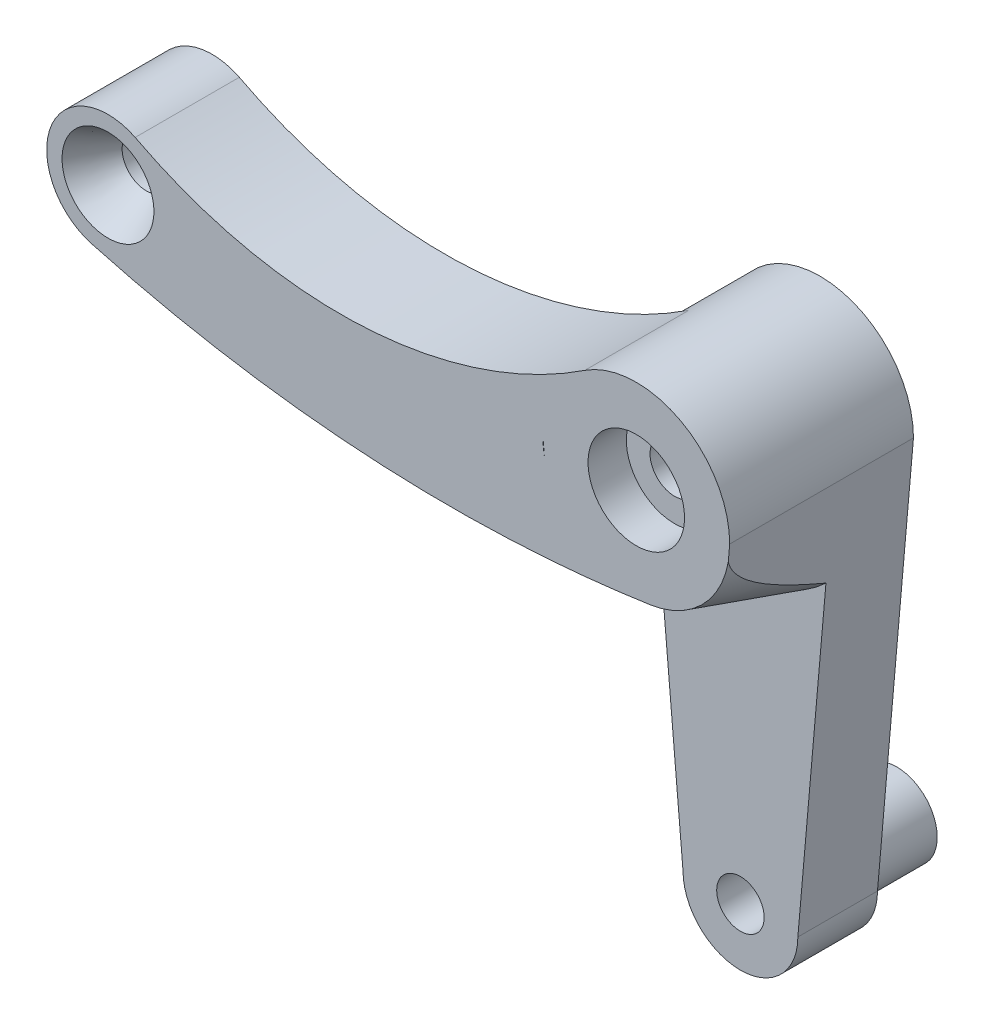
ISO-10303-21;
HEADER;
FILE_DESCRIPTION(('STEP AP214'),'2;1');
FILE_NAME('part.step','',(''),(''),'','','');
FILE_SCHEMA(('AUTOMOTIVE_DESIGN { 1 0 10303 214 1 1 1 1 }'));
ENDSEC;
DATA;
#1=APPLICATION_CONTEXT('core data for automotive mechanical design processes');
#2=APPLICATION_PROTOCOL_DEFINITION('international standard','automotive_design',2000,#1);
#3=PRODUCT_CONTEXT('',#1,'mechanical');
#4=PRODUCT('Part','Part','',(#3));
#5=PRODUCT_RELATED_PRODUCT_CATEGORY('part','',(#4));
#6=PRODUCT_DEFINITION_FORMATION('','',#4);
#7=PRODUCT_DEFINITION_CONTEXT('part definition',#1,'design');
#8=PRODUCT_DEFINITION('design','',#6,#7);
#9=PRODUCT_DEFINITION_SHAPE('','',#8);
#10=(LENGTH_UNIT() NAMED_UNIT(*) SI_UNIT(.MILLI.,.METRE.));
#11=(NAMED_UNIT(*) PLANE_ANGLE_UNIT() SI_UNIT($,.RADIAN.));
#12=(NAMED_UNIT(*) SI_UNIT($,.STERADIAN.) SOLID_ANGLE_UNIT());
#13=UNCERTAINTY_MEASURE_WITH_UNIT(LENGTH_MEASURE(1.E-05),#10,'distance_accuracy_value','');
#14=(GEOMETRIC_REPRESENTATION_CONTEXT(3) GLOBAL_UNCERTAINTY_ASSIGNED_CONTEXT((#13)) GLOBAL_UNIT_ASSIGNED_CONTEXT((#10,
#11,#12)) REPRESENTATION_CONTEXT('',''));
#15=CARTESIAN_POINT('',(0.,0.,0.));
#16=DIRECTION('',(0.,0.,1.));
#17=DIRECTION('',(1.,0.,0.));
#18=AXIS2_PLACEMENT_3D('',#15,#16,#17);
#19=CARTESIAN_POINT('',(-34.5,0.,12.));
#20=DIRECTION('',(0.,0.,-1.));
#21=DIRECTION('',(-1.,0.,0.));
#22=AXIS2_PLACEMENT_3D('',#19,#20,#21);
#23=CYLINDRICAL_SURFACE('',#22,1.575);
#24=CARTESIAN_POINT('',(-34.5,0.,5.2));
#25=DIRECTION('',(0.,0.,1.));
#26=DIRECTION('',(1.,0.,0.));
#27=AXIS2_PLACEMENT_3D('',#24,#25,#26);
#28=CIRCLE('',#27,1.575);
#29=CARTESIAN_POINT('',(-32.925,0.,5.2));
#30=VERTEX_POINT('',#29);
#31=EDGE_CURVE('E334',#30,#30,#28,.T.);
#32=ORIENTED_EDGE('',*,*,#31,.F.);
#33=EDGE_LOOP('',(#32));
#34=FACE_BOUND('',#33,.T.);
#35=CARTESIAN_POINT('',(-34.5,0.,9.5));
#36=DIRECTION('',(0.,0.,-1.));
#37=DIRECTION('',(-1.,0.,0.));
#38=AXIS2_PLACEMENT_3D('',#35,#36,#37);
#39=CIRCLE('',#38,1.575);
#40=CARTESIAN_POINT('',(-36.075,0.,9.5));
#41=VERTEX_POINT('',#40);
#42=EDGE_CURVE('E367',#41,#41,#39,.T.);
#43=ORIENTED_EDGE('',*,*,#42,.F.);
#44=EDGE_LOOP('',(#43));
#45=FACE_BOUND('',#44,.T.);
#46=ADVANCED_FACE('F35',(#34,#45),#23,.F.);
#47=CARTESIAN_POINT('',(0.,0.,12.));
#48=DIRECTION('',(0.,0.,-1.));
#49=DIRECTION('',(-1.,0.,0.));
#50=AXIS2_PLACEMENT_3D('',#47,#48,#49);
#51=CYLINDRICAL_SURFACE('',#50,1.6);
#52=CARTESIAN_POINT('',(0.,0.,2.5));
#53=DIRECTION('',(0.,0.,-1.));
#54=DIRECTION('',(-1.,0.,0.));
#55=AXIS2_PLACEMENT_3D('',#52,#53,#54);
#56=CIRCLE('',#55,1.6);
#57=CARTESIAN_POINT('',(-1.6,0.,2.5));
#58=VERTEX_POINT('',#57);
#59=EDGE_CURVE('E40',#58,#58,#56,.T.);
#60=ORIENTED_EDGE('',*,*,#59,.T.);
#61=EDGE_LOOP('',(#60));
#62=FACE_BOUND('',#61,.T.);
#63=CARTESIAN_POINT('',(0.,0.,9.5));
#64=DIRECTION('',(0.,0.,1.));
#65=DIRECTION('',(1.,0.,0.));
#66=AXIS2_PLACEMENT_3D('',#63,#64,#65);
#67=CIRCLE('',#66,1.6);
#68=CARTESIAN_POINT('',(1.6,0.,9.5));
#69=VERTEX_POINT('',#68);
#70=EDGE_CURVE('E362',#69,#69,#67,.T.);
#71=ORIENTED_EDGE('',*,*,#70,.T.);
#72=EDGE_LOOP('',(#71));
#73=FACE_BOUND('',#72,.T.);
#74=ADVANCED_FACE('F255',(#62,#73),#51,.F.);
#75=CARTESIAN_POINT('',(0.,0.,12.));
#76=DIRECTION('',(0.,0.,-1.));
#77=DIRECTION('',(-1.,0.,0.));
#78=AXIS2_PLACEMENT_3D('',#75,#76,#77);
#79=CYLINDRICAL_SURFACE('',#78,6.1);
#80=CARTESIAN_POINT('',(0.,0.,5.2));
#81=DIRECTION('',(0.,0.,-1.));
#82=DIRECTION('',(1.,0.,0.));
#83=AXIS2_PLACEMENT_3D('',#80,#81,#82);
#84=CIRCLE('',#83,6.1);
#85=CARTESIAN_POINT('',(-6.1,0.,5.2));
#86=VERTEX_POINT('',#85);
#87=CARTESIAN_POINT('',(-3.36501602680877,5.08789417532638,5.2));
#88=VERTEX_POINT('',#87);
#89=EDGE_CURVE('E346',#86,#88,#84,.T.);
#90=ORIENTED_EDGE('',*,*,#89,.T.);
#91=DIRECTION('',(0.,0.,-1.));
#92=VECTOR('',#91,1.);
#93=CARTESIAN_POINT('',(-3.36501602680877,5.08789417532638,12.));
#94=LINE('',#93,#92);
#95=CARTESIAN_POINT('',(-3.36501602680877,5.08789417532638,12.));
#96=VERTEX_POINT('',#95);
#97=EDGE_CURVE('E155',#96,#88,#94,.T.);
#98=ORIENTED_EDGE('',*,*,#97,.F.);
#99=CARTESIAN_POINT('',(0.,0.,12.));
#100=DIRECTION('',(0.,0.,1.));
#101=DIRECTION('',(1.,0.,0.));
#102=AXIS2_PLACEMENT_3D('',#99,#100,#101);
#103=CIRCLE('',#102,6.1);
#104=CARTESIAN_POINT('',(6.1,0.,12.));
#105=VERTEX_POINT('',#104);
#106=EDGE_CURVE('E142',#105,#96,#103,.T.);
#107=ORIENTED_EDGE('',*,*,#106,.F.);
#108=DIRECTION('',(0.,0.,-1.));
#109=VECTOR('',#108,1.);
#110=CARTESIAN_POINT('',(6.1,0.,12.));
#111=LINE('',#110,#109);
#112=CARTESIAN_POINT('',(6.1,0.,0.));
#113=VERTEX_POINT('',#112);
#114=EDGE_CURVE('E200',#105,#113,#111,.T.);
#115=ORIENTED_EDGE('',*,*,#114,.T.);
#116=CARTESIAN_POINT('',(0.,0.,0.));
#117=DIRECTION('',(0.,0.,1.));
#118=DIRECTION('',(1.,0.,0.));
#119=AXIS2_PLACEMENT_3D('',#116,#117,#118);
#120=CIRCLE('',#119,6.1);
#121=CARTESIAN_POINT('',(-6.1,0.,0.));
#122=VERTEX_POINT('',#121);
#123=EDGE_CURVE('E190',#113,#122,#120,.T.);
#124=ORIENTED_EDGE('',*,*,#123,.T.);
#125=DIRECTION('',(0.,0.,-1.));
#126=VECTOR('',#125,1.);
#127=CARTESIAN_POINT('',(-6.1,0.,12.));
#128=LINE('',#127,#126);
#129=EDGE_CURVE('E196',#86,#122,#128,.T.);
#130=ORIENTED_EDGE('',*,*,#129,.F.);
#131=EDGE_LOOP('',(#90,#98,#107,#115,#124,#130));
#132=FACE_BOUND('',#131,.T.);
#133=ADVANCED_FACE('F252',(#132),#79,.T.);
#134=CARTESIAN_POINT('',(0.,0.,5.2));
#135=DIRECTION('',(0.,0.,1.));
#136=DIRECTION('',(1.,0.,0.));
#137=AXIS2_PLACEMENT_3D('',#134,#135,#136);
#138=PLANE('',#137);
#139=CARTESIAN_POINT('',(0.,-26.8,5.2));
#140=DIRECTION('',(0.,0.,1.));
#141=DIRECTION('',(1.,0.,0.));
#142=AXIS2_PLACEMENT_3D('',#139,#140,#141);
#143=CIRCLE('',#142,1.55);
#144=CARTESIAN_POINT('',(1.55,-26.8,5.2));
#145=VERTEX_POINT('',#144);
#146=EDGE_CURVE('E176',#145,#145,#143,.T.);
#147=ORIENTED_EDGE('',*,*,#146,.F.);
#148=EDGE_LOOP('',(#147));
#149=FACE_BOUND('',#148,.T.);
#150=CARTESIAN_POINT('',(0.,0.,5.2));
#151=DIRECTION('',(0.,0.,1.));
#152=DIRECTION('',(1.,0.,0.));
#153=AXIS2_PLACEMENT_3D('',#150,#151,#152);
#154=CIRCLE('',#153,8.1);
#155=CARTESIAN_POINT('',(5.58562427825305,-5.86607206077372,5.2));
#156=VERTEX_POINT('',#155);
#157=CARTESIAN_POINT('',(1.19677567262764,-8.01110029829902,5.2));
#158=VERTEX_POINT('',#157);
#159=EDGE_CURVE('E213',#156,#158,#154,.F.);
#160=ORIENTED_EDGE('',*,*,#159,.T.);
#161=CARTESIAN_POINT('',(-12.1716520767408,81.4758586867667,5.2));
#162=DIRECTION('',(0.,0.,1.));
#163=DIRECTION('',(1.,0.,0.));
#164=AXIS2_PLACEMENT_3D('',#161,#162,#163);
#165=CIRCLE('',#164,90.4800015964021);
#166=CARTESIAN_POINT('',(-5.33315072148599,-8.74534496347895,5.2));
#167=VERTEX_POINT('',#166);
#168=EDGE_CURVE('E215',#158,#167,#165,.F.);
#169=ORIENTED_EDGE('',*,*,#168,.T.);
#170=DIRECTION('',(0.0873513906763995,-0.996177561756386,0.));
#171=VECTOR('',#170,1.);
#172=CARTESIAN_POINT('',(-6.00691076147216,-1.06161344363656,5.2));
#173=LINE('',#172,#171);
#174=CARTESIAN_POINT('',(-3.75,-26.8,5.2));
#175=VERTEX_POINT('',#174);
#176=EDGE_CURVE('E166',#167,#175,#173,.T.);
#177=ORIENTED_EDGE('',*,*,#176,.T.);
#178=CARTESIAN_POINT('',(0.,-26.8,5.2));
#179=DIRECTION('',(0.,0.,1.));
#180=DIRECTION('',(1.,0.,0.));
#181=AXIS2_PLACEMENT_3D('',#178,#179,#180);
#182=CIRCLE('',#181,3.75);
#183=CARTESIAN_POINT('',(3.75,-26.8,5.2));
#184=VERTEX_POINT('',#183);
#185=EDGE_CURVE('E165',#175,#184,#182,.T.);
#186=ORIENTED_EDGE('',*,*,#185,.T.);
#187=DIRECTION('',(0.0873513906763995,0.996177561756386,0.));
#188=VECTOR('',#187,1.);
#189=CARTESIAN_POINT('',(3.75,-26.8,5.2));
#190=LINE('',#189,#188);
#191=EDGE_CURVE('E168',#184,#156,#190,.T.);
#192=ORIENTED_EDGE('',*,*,#191,.T.);
#193=EDGE_LOOP('',(#160,#169,#177,#186,#192));
#194=FACE_BOUND('',#193,.T.);
#195=ADVANCED_FACE('F254',(#149,#194),#138,.T.);
#196=CARTESIAN_POINT('',(0.,-26.8,0.));
#197=DIRECTION('',(0.,0.,1.));
#198=DIRECTION('',(1.,0.,0.));
#199=AXIS2_PLACEMENT_3D('',#196,#197,#198);
#200=PLANE('',#199);
#201=CARTESIAN_POINT('',(0.,0.,0.));
#202=DIRECTION('',(0.,0.,-1.));
#203=DIRECTION('',(-1.,0.,0.));
#204=AXIS2_PLACEMENT_3D('',#201,#202,#203);
#205=CIRCLE('',#204,3.15);
#206=CARTESIAN_POINT('',(-3.15,0.,0.));
#207=VERTEX_POINT('',#206);
#208=EDGE_CURVE('E310',#207,#207,#205,.T.);
#209=ORIENTED_EDGE('',*,*,#208,.F.);
#210=EDGE_LOOP('',(#209));
#211=FACE_BOUND('',#210,.T.);
#212=CARTESIAN_POINT('',(0.,-26.8,0.));
#213=DIRECTION('',(0.,0.,1.));
#214=DIRECTION('',(1.,0.,0.));
#215=AXIS2_PLACEMENT_3D('',#212,#213,#214);
#216=CIRCLE('',#215,3.15);
#217=CARTESIAN_POINT('',(3.15,-26.8,0.));
#218=VERTEX_POINT('',#217);
#219=EDGE_CURVE('E210',#218,#218,#216,.T.);
#220=ORIENTED_EDGE('',*,*,#219,.T.);
#221=EDGE_LOOP('',(#220));
#222=FACE_BOUND('',#221,.T.);
#223=CARTESIAN_POINT('',(0.,-26.8,0.));
#224=DIRECTION('',(0.,0.,1.));
#225=DIRECTION('',(1.,0.,0.));
#226=AXIS2_PLACEMENT_3D('',#223,#224,#225);
#227=CIRCLE('',#226,3.75);
#228=CARTESIAN_POINT('',(-3.75,-26.8,0.));
#229=VERTEX_POINT('',#228);
#230=CARTESIAN_POINT('',(3.75,-26.8,0.));
#231=VERTEX_POINT('',#230);
#232=EDGE_CURVE('E185',#229,#231,#227,.T.);
#233=ORIENTED_EDGE('',*,*,#232,.F.);
#234=DIRECTION('',(0.0873513906763996,-0.996177561756386,0.));
#235=VECTOR('',#234,1.);
#236=CARTESIAN_POINT('',(-3.75,-26.8,0.));
#237=LINE('',#236,#235);
#238=EDGE_CURVE('E179',#122,#229,#237,.T.);
#239=ORIENTED_EDGE('',*,*,#238,.F.);
#240=ORIENTED_EDGE('',*,*,#123,.F.);
#241=DIRECTION('',(0.0873513906763996,0.996177561756386,0.));
#242=VECTOR('',#241,1.);
#243=CARTESIAN_POINT('',(6.1,0.,0.));
#244=LINE('',#243,#242);
#245=EDGE_CURVE('E188',#231,#113,#244,.T.);
#246=ORIENTED_EDGE('',*,*,#245,.F.);
#247=EDGE_LOOP('',(#233,#239,#240,#246));
#248=FACE_BOUND('',#247,.T.);
#249=ADVANCED_FACE('F246',(#211,#222,#248),#200,.F.);
#250=CARTESIAN_POINT('',(0.,-26.8,12.));
#251=DIRECTION('',(0.,0.,-1.));
#252=DIRECTION('',(-1.,0.,0.));
#253=AXIS2_PLACEMENT_3D('',#250,#251,#252);
#254=CYLINDRICAL_SURFACE('',#253,3.75);
#255=ORIENTED_EDGE('',*,*,#185,.F.);
#256=DIRECTION('',(0.,0.,-1.));
#257=VECTOR('',#256,1.);
#258=CARTESIAN_POINT('',(-3.75,-26.8,12.));
#259=LINE('',#258,#257);
#260=EDGE_CURVE('E184',#175,#229,#259,.T.);
#261=ORIENTED_EDGE('',*,*,#260,.T.);
#262=ORIENTED_EDGE('',*,*,#232,.T.);
#263=DIRECTION('',(0.,0.,-1.));
#264=VECTOR('',#263,1.);
#265=CARTESIAN_POINT('',(3.75,-26.8,12.));
#266=LINE('',#265,#264);
#267=EDGE_CURVE('E203',#184,#231,#266,.T.);
#268=ORIENTED_EDGE('',*,*,#267,.F.);
#269=EDGE_LOOP('',(#255,#261,#262,#268));
#270=FACE_BOUND('',#269,.T.);
#271=ADVANCED_FACE('F243',(#270),#254,.T.);
#272=CARTESIAN_POINT('',(0.,-26.8,12.));
#273=DIRECTION('',(0.,0.,-1.));
#274=DIRECTION('',(-1.,0.,0.));
#275=AXIS2_PLACEMENT_3D('',#272,#273,#274);
#276=CYLINDRICAL_SURFACE('',#275,1.55);
#277=ORIENTED_EDGE('',*,*,#146,.T.);
#278=EDGE_LOOP('',(#277));
#279=FACE_BOUND('',#278,.T.);
#280=CARTESIAN_POINT('',(0.,-26.8,-5.));
#281=DIRECTION('',(0.,0.,-1.));
#282=DIRECTION('',(-1.,0.,0.));
#283=AXIS2_PLACEMENT_3D('',#280,#281,#282);
#284=CIRCLE('',#283,1.55);
#285=CARTESIAN_POINT('',(-1.55,-26.8,-5.));
#286=VERTEX_POINT('',#285);
#287=EDGE_CURVE('E150',#286,#286,#284,.T.);
#288=ORIENTED_EDGE('',*,*,#287,.T.);
#289=EDGE_LOOP('',(#288));
#290=FACE_BOUND('',#289,.T.);
#291=ADVANCED_FACE('F245',(#279,#290),#276,.F.);
#292=CARTESIAN_POINT('',(0.,-26.8,12.));
#293=DIRECTION('',(0.,0.,1.));
#294=DIRECTION('',(1.,0.,0.));
#295=AXIS2_PLACEMENT_3D('',#292,#293,#294);
#296=PLANE('',#295);
#297=CARTESIAN_POINT('',(-34.5,0.,12.));
#298=DIRECTION('',(0.,0.,-1.));
#299=DIRECTION('',(-1.,0.,0.));
#300=AXIS2_PLACEMENT_3D('',#297,#298,#299);
#301=CIRCLE('',#300,3.);
#302=CARTESIAN_POINT('',(-37.5,0.,12.));
#303=VERTEX_POINT('',#302);
#304=EDGE_CURVE('E370',#303,#303,#301,.T.);
#305=ORIENTED_EDGE('',*,*,#304,.T.);
#306=EDGE_LOOP('',(#305));
#307=FACE_BOUND('',#306,.T.);
#308=CARTESIAN_POINT('',(0.,0.,12.));
#309=DIRECTION('',(0.,0.,1.));
#310=DIRECTION('',(1.,0.,0.));
#311=AXIS2_PLACEMENT_3D('',#308,#309,#310);
#312=CIRCLE('',#311,3.15);
#313=CARTESIAN_POINT('',(3.15,0.,12.));
#314=VERTEX_POINT('',#313);
#315=EDGE_CURVE('E359',#314,#314,#312,.T.);
#316=ORIENTED_EDGE('',*,*,#315,.F.);
#317=EDGE_LOOP('',(#316));
#318=FACE_BOUND('',#317,.T.);
#319=ORIENTED_EDGE('',*,*,#106,.T.);
#320=CARTESIAN_POINT('',(-19.3185063382412,29.2095238451383,12.));
#321=DIRECTION('',(0.,0.,-1.));
#322=DIRECTION('',(1.,0.,0.));
#323=AXIS2_PLACEMENT_3D('',#320,#321,#322);
#324=CIRCLE('',#323,28.9200081439221);
#325=CARTESIAN_POINT('',(-32.7223042418856,3.58326635788941,12.));
#326=VERTEX_POINT('',#325);
#327=EDGE_CURVE('E136',#96,#326,#324,.T.);
#328=ORIENTED_EDGE('',*,*,#327,.T.);
#329=CARTESIAN_POINT('',(-34.5,0.,12.));
#330=DIRECTION('',(0.,0.,1.));
#331=DIRECTION('',(1.,0.,0.));
#332=AXIS2_PLACEMENT_3D('',#329,#330,#331);
#333=CIRCLE('',#332,4.);
#334=CARTESIAN_POINT('',(-35.5572134233582,-3.85775838764835,12.));
#335=VERTEX_POINT('',#334);
#336=EDGE_CURVE('E124',#326,#335,#333,.T.);
#337=ORIENTED_EDGE('',*,*,#336,.T.);
#338=CARTESIAN_POINT('',(-12.1716520767408,81.4758586867667,12.));
#339=DIRECTION('',(0.,0.,1.));
#340=DIRECTION('',(1.,0.,0.));
#341=AXIS2_PLACEMENT_3D('',#338,#339,#340);
#342=CIRCLE('',#341,88.480001596402);
#343=CARTESIAN_POINT('',(-5.50786596339798,-6.7528477365677,12.));
#344=VERTEX_POINT('',#343);
#345=EDGE_CURVE('E335',#335,#344,#342,.T.);
#346=ORIENTED_EDGE('',*,*,#345,.T.);
#347=CARTESIAN_POINT('',(0.901275506546741,-6.03305084192889,12.));
#348=VERTEX_POINT('',#347);
#349=EDGE_CURVE('E135',#344,#348,#342,.T.);
#350=ORIENTED_EDGE('',*,*,#349,.T.);
#351=CARTESIAN_POINT('',(0.,0.,12.));
#352=DIRECTION('',(0.,0.,-1.));
#353=DIRECTION('',(1.,0.,0.));
#354=AXIS2_PLACEMENT_3D('',#351,#352,#353);
#355=CIRCLE('',#354,6.1);
#356=CARTESIAN_POINT('',(6.00691076147217,-1.06161344363654,12.));
#357=VERTEX_POINT('',#356);
#358=EDGE_CURVE('E161',#357,#348,#355,.T.);
#359=ORIENTED_EDGE('',*,*,#358,.F.);
#360=DIRECTION('',(0.0873513906763996,0.996177561756386,0.));
#361=VECTOR('',#360,1.);
#362=CARTESIAN_POINT('',(6.1,0.,12.));
#363=LINE('',#362,#361);
#364=EDGE_CURVE('E177',#357,#105,#363,.T.);
#365=ORIENTED_EDGE('',*,*,#364,.T.);
#366=EDGE_LOOP('',(#319,#328,#337,#346,#350,#359,#365));
#367=FACE_BOUND('',#366,.T.);
#368=CARTESIAN_POINT('',(0.,0.,12.));
#369=DIRECTION('',(0.,0.,-1.));
#370=DIRECTION('',(1.,0.,0.));
#371=AXIS2_PLACEMENT_3D('',#368,#369,#370);
#372=CIRCLE('',#371,6.1);
#373=CARTESIAN_POINT('',(-6.00691076147217,-1.06161344363656,12.));
#374=VERTEX_POINT('',#373);
#375=CARTESIAN_POINT('',(-6.1,0.,12.));
#376=VERTEX_POINT('',#375);
#377=EDGE_CURVE('E337',#374,#376,#372,.T.);
#378=ORIENTED_EDGE('',*,*,#377,.T.);
#379=DIRECTION('',(0.0873513906763996,-0.996177561756386,0.));
#380=VECTOR('',#379,1.);
#381=CARTESIAN_POINT('',(-3.75,-26.8,12.));
#382=LINE('',#381,#380);
#383=EDGE_CURVE('E181',#376,#374,#382,.T.);
#384=ORIENTED_EDGE('',*,*,#383,.T.);
#385=EDGE_LOOP('',(#378,#384));
#386=FACE_BOUND('',#385,.T.);
#387=ADVANCED_FACE('F139',(#307,#318,#367,#386),#296,.T.);
#388=CARTESIAN_POINT('',(6.1,0.,12.));
#389=DIRECTION('',(-0.996177561756386,0.0873513906763996,0.));
#390=DIRECTION('',(-0.0873513906763996,-0.996177561756386,0.));
#391=AXIS2_PLACEMENT_3D('',#388,#389,#390);
#392=PLANE('',#391);
#393=ORIENTED_EDGE('',*,*,#364,.F.);
#394=CARTESIAN_POINT('',(6.00691076147217,-1.06161344363654,12.));
#395=CARTESIAN_POINT('',(5.99959290657591,-1.14506812926192,11.9751362120786));
#396=CARTESIAN_POINT('',(5.99243235980993,-1.22672883280593,11.9449550579356));
#397=CARTESIAN_POINT('',(5.97847258999629,-1.38592961195723,11.875879947173));
#398=CARTESIAN_POINT('',(5.9716719683851,-1.4634856371401,11.8370233346674));
#399=CARTESIAN_POINT('',(5.9520605990004,-1.68713870076144,11.7116434654856));
#400=CARTESIAN_POINT('',(5.93974067235911,-1.8276382896918,11.6151440803785));
#401=CARTESIAN_POINT('',(5.91544789226449,-2.10467935630285,11.3977095441893));
#402=CARTESIAN_POINT('',(5.90356521581586,-2.2401924323979,11.2755087663684));
#403=CARTESIAN_POINT('',(5.88086373731854,-2.49908588930343,11.018665461085));
#404=CARTESIAN_POINT('',(5.87004637830578,-2.62244981336389,10.8840065241382));
#405=CARTESIAN_POINT('',(5.84895494164729,-2.86298194206493,10.6024445651833));
#406=CARTESIAN_POINT('',(5.83870594811579,-2.97986408106249,10.455298842726));
#407=CARTESIAN_POINT('',(5.81891825837843,-3.2055279470034,10.1550985524621));
#408=CARTESIAN_POINT('',(5.80937907159271,-3.31431526864485,10.0020481788367));
#409=CARTESIAN_POINT('',(5.7887895818787,-3.54912306623438,9.65686973716212));
#410=CARTESIAN_POINT('',(5.77787859154305,-3.67355478580691,9.46365880553215));
#411=CARTESIAN_POINT('',(5.75670729540617,-3.91499765238915,9.07259651436457));
#412=CARTESIAN_POINT('',(5.74644714893255,-4.03200698238626,8.87474403468251));
#413=CARTESIAN_POINT('',(5.72643438988905,-4.2602375961589,8.47533693525285));
#414=CARTESIAN_POINT('',(5.71668253596197,-4.3714502281784,8.27377735671169));
#415=CARTESIAN_POINT('',(5.69760506355262,-4.58901459437862,7.86802950031076));
#416=CARTESIAN_POINT('',(5.68827946630312,-4.69536608641545,7.66384109215122));
#417=CARTESIAN_POINT('',(5.6708452773313,-4.89419002873236,7.27275622565571));
#418=CARTESIAN_POINT('',(5.66270485526182,-4.98702548041842,7.08604509495851));
#419=CARTESIAN_POINT('',(5.64667240975651,-5.16986358235133,6.71122496150828));
#420=CARTESIAN_POINT('',(5.63878039452783,-5.25986613900172,6.52311591282251));
#421=CARTESIAN_POINT('',(5.62323767587374,-5.43711927088676,6.14638500444437));
#422=CARTESIAN_POINT('',(5.61558623934931,-5.52437820656962,5.95776709992487));
#423=CARTESIAN_POINT('',(5.60047114905192,-5.69675455549298,5.57956788235996));
#424=CARTESIAN_POINT('',(5.59300747820271,-5.78187216347542,5.38998665882175));
#425=CARTESIAN_POINT('',(5.58562427825302,-5.86607206077408,5.20000000000024));
#426=B_SPLINE_CURVE_WITH_KNOTS('',3,(#394,#395,#396,#397,#398,#399,#400,#401,#402,#403,#404,
#405,#406,#407,#408,#409,#410,#411,#412,#413,#414,#415,#416,#417,#418,#419,#420,#421,#422,#423,
#424,#425),.UNSPECIFIED.,.F.,.F.,(4,2,2,2,2,2,2,2,2,2,2,2,2,2,2,4),(0.,0.261662991599172,
0.522220638804977,1.03265787208609,1.58016338965039,2.12840061963555,2.69264497011371,
3.25649565177873,3.9464781448824,4.63662890007616,5.32778184670861,6.01896918372801,
6.64497054759166,7.27099257234823,7.894873198066,8.51869687865698),.UNSPECIFIED.);
#427=EDGE_CURVE('E11',#357,#156,#426,.T.);
#428=ORIENTED_EDGE('',*,*,#427,.T.);
#429=ORIENTED_EDGE('',*,*,#191,.F.);
#430=ORIENTED_EDGE('',*,*,#267,.T.);
#431=ORIENTED_EDGE('',*,*,#245,.T.);
#432=ORIENTED_EDGE('',*,*,#114,.F.);
#433=EDGE_LOOP('',(#393,#428,#429,#430,#431,#432));
#434=FACE_BOUND('',#433,.T.);
#435=ADVANCED_FACE('F248',(#434),#392,.F.);
#436=CARTESIAN_POINT('',(-3.75,-26.8,12.));
#437=DIRECTION('',(0.996177561756386,0.0873513906763996,0.));
#438=DIRECTION('',(-0.0873513906763996,0.996177561756386,0.));
#439=AXIS2_PLACEMENT_3D('',#436,#437,#438);
#440=PLANE('',#439);
#441=CARTESIAN_POINT('',(-6.00691076147217,-1.06161344363654,5.2));
#442=VERTEX_POINT('',#441);
#443=CARTESIAN_POINT('',(-5.50786596339798,-6.75284773656769,5.2));
#444=VERTEX_POINT('',#443);
#445=EDGE_CURVE('E162',#442,#444,#173,.T.);
#446=ORIENTED_EDGE('',*,*,#445,.F.);
#447=DIRECTION('',(0.,0.,1.));
#448=VECTOR('',#447,1.);
#449=CARTESIAN_POINT('',(-6.00691076147216,-1.06161344363656,5.2));
#450=LINE('',#449,#448);
#451=EDGE_CURVE('E171',#442,#374,#450,.T.);
#452=ORIENTED_EDGE('',*,*,#451,.T.);
#453=ORIENTED_EDGE('',*,*,#383,.F.);
#454=EDGE_CURVE('E197',#376,#86,#128,.T.);
#455=ORIENTED_EDGE('',*,*,#454,.T.);
#456=ORIENTED_EDGE('',*,*,#129,.T.);
#457=ORIENTED_EDGE('',*,*,#238,.T.);
#458=ORIENTED_EDGE('',*,*,#260,.F.);
#459=ORIENTED_EDGE('',*,*,#176,.F.);
#460=CARTESIAN_POINT('',(-5.33315072148599,-8.74534496347895,5.2));
#461=CARTESIAN_POINT('',(-5.36226988574455,-8.41326257959401,6.33333347720731));
#462=CARTESIAN_POINT('',(-5.3913890713665,-8.0811799520756,7.46666688247763));
#463=CARTESIAN_POINT('',(-5.44962748533717,-7.41701420977185,9.7333335491443));
#464=CARTESIAN_POINT('',(-5.47874671368588,-7.08493109498651,10.8666668105406));
#465=CARTESIAN_POINT('',(-5.50786596339798,-6.7528477365677,12.));
#466=B_SPLINE_CURVE_WITH_KNOTS('',3,(#460,#461,#462,#463,#464,#465),.UNSPECIFIED.,.F.,.F.,(4,2,
4),(0.,3.54402915531912,7.08805831063824),.UNSPECIFIED.);
#467=EDGE_CURVE('E45',#167,#344,#466,.T.);
#468=ORIENTED_EDGE('',*,*,#467,.T.);
#469=DIRECTION('',(0.,0.,-1.));
#470=VECTOR('',#469,1.);
#471=CARTESIAN_POINT('',(-5.50786596339798,-6.75284773656769,5.2));
#472=LINE('',#471,#470);
#473=EDGE_CURVE('E53',#444,#344,#472,.F.);
#474=ORIENTED_EDGE('',*,*,#473,.F.);
#475=EDGE_LOOP('',(#446,#452,#453,#455,#456,#457,#458,#459,#468,#474));
#476=FACE_BOUND('',#475,.T.);
#477=ADVANCED_FACE('F227',(#476),#440,.F.);
#478=CARTESIAN_POINT('',(0.,-26.8,-5.));
#479=DIRECTION('',(0.,0.,-1.));
#480=DIRECTION('',(-1.,0.,0.));
#481=AXIS2_PLACEMENT_3D('',#478,#479,#480);
#482=PLANE('',#481);
#483=CARTESIAN_POINT('',(0.,-26.8,-5.));
#484=DIRECTION('',(0.,0.,-1.));
#485=DIRECTION('',(-1.,0.,0.));
#486=AXIS2_PLACEMENT_3D('',#483,#484,#485);
#487=CIRCLE('',#486,2.65);
#488=CARTESIAN_POINT('',(-2.65,-26.8,-5.));
#489=VERTEX_POINT('',#488);
#490=EDGE_CURVE('E153',#489,#489,#487,.T.);
#491=ORIENTED_EDGE('',*,*,#490,.T.);
#492=EDGE_LOOP('',(#491));
#493=FACE_BOUND('',#492,.T.);
#494=ORIENTED_EDGE('',*,*,#287,.F.);
#495=EDGE_LOOP('',(#494));
#496=FACE_BOUND('',#495,.T.);
#497=ADVANCED_FACE('F291',(#493,#496),#482,.T.);
#498=CARTESIAN_POINT('',(0.,-26.8,-5.));
#499=DIRECTION('',(0.,0.,1.));
#500=DIRECTION('',(1.,0.,0.));
#501=AXIS2_PLACEMENT_3D('',#498,#499,#500);
#502=CYLINDRICAL_SURFACE('',#501,2.65);
#503=CARTESIAN_POINT('',(0.,-26.8,-0.499999999999997));
#504=DIRECTION('',(0.,0.,1.));
#505=DIRECTION('',(1.,0.,0.));
#506=AXIS2_PLACEMENT_3D('',#503,#504,#505);
#507=CIRCLE('',#506,2.65);
#508=CARTESIAN_POINT('',(2.65,-26.8,-0.499999999999997));
#509=VERTEX_POINT('',#508);
#510=EDGE_CURVE('E205',#509,#509,#507,.F.);
#511=ORIENTED_EDGE('',*,*,#510,.T.);
#512=EDGE_LOOP('',(#511));
#513=FACE_BOUND('',#512,.T.);
#514=ORIENTED_EDGE('',*,*,#490,.F.);
#515=EDGE_LOOP('',(#514));
#516=FACE_BOUND('',#515,.T.);
#517=ADVANCED_FACE('F241',(#513,#516),#502,.T.);
#518=CARTESIAN_POINT('',(0.,-26.8,-0.499999999999997));
#519=DIRECTION('',(0.,0.,1.));
#520=DIRECTION('',(1.,0.,0.));
#521=AXIS2_PLACEMENT_3D('',#518,#519,#520);
#522=CONICAL_SURFACE('',#521,2.65,0.785398163397448);
#523=ORIENTED_EDGE('',*,*,#219,.F.);
#524=EDGE_LOOP('',(#523));
#525=FACE_BOUND('',#524,.T.);
#526=ORIENTED_EDGE('',*,*,#510,.F.);
#527=EDGE_LOOP('',(#526));
#528=FACE_BOUND('',#527,.T.);
#529=ADVANCED_FACE('F237',(#525,#528),#522,.T.);
#530=CARTESIAN_POINT('',(-9.65925316912062,14.6047619225692,5.2));
#531=DIRECTION('',(0.,0.,1.));
#532=DIRECTION('',(1.,0.,0.));
#533=AXIS2_PLACEMENT_3D('',#530,#531,#532);
#534=PLANE('',#533);
#535=ORIENTED_EDGE('',*,*,#31,.T.);
#536=EDGE_LOOP('',(#535));
#537=FACE_BOUND('',#536,.T.);
#538=EDGE_CURVE('E145',#442,#86,#84,.T.);
#539=ORIENTED_EDGE('',*,*,#538,.F.);
#540=ORIENTED_EDGE('',*,*,#445,.T.);
#541=CARTESIAN_POINT('',(-12.1716520767408,81.4758586867667,5.2));
#542=DIRECTION('',(0.,0.,1.));
#543=DIRECTION('',(1.,0.,0.));
#544=AXIS2_PLACEMENT_3D('',#541,#542,#543);
#545=CIRCLE('',#544,88.480001596402);
#546=CARTESIAN_POINT('',(-35.5572134233582,-3.85775838764835,5.2));
#547=VERTEX_POINT('',#546);
#548=EDGE_CURVE('E344',#547,#444,#545,.T.);
#549=ORIENTED_EDGE('',*,*,#548,.F.);
#550=CARTESIAN_POINT('',(-34.5,0.,5.2));
#551=DIRECTION('',(0.,0.,1.));
#552=DIRECTION('',(1.,0.,0.));
#553=AXIS2_PLACEMENT_3D('',#550,#551,#552);
#554=CIRCLE('',#553,4.);
#555=CARTESIAN_POINT('',(-32.7223042418856,3.58326635788941,5.2));
#556=VERTEX_POINT('',#555);
#557=EDGE_CURVE('E342',#556,#547,#554,.T.);
#558=ORIENTED_EDGE('',*,*,#557,.F.);
#559=CARTESIAN_POINT('',(-19.3185063382412,29.2095238451383,5.2));
#560=DIRECTION('',(0.,0.,-1.));
#561=DIRECTION('',(1.,0.,0.));
#562=AXIS2_PLACEMENT_3D('',#559,#560,#561);
#563=CIRCLE('',#562,28.9200081439221);
#564=EDGE_CURVE('E149',#88,#556,#563,.T.);
#565=ORIENTED_EDGE('',*,*,#564,.F.);
#566=ORIENTED_EDGE('',*,*,#89,.F.);
#567=EDGE_LOOP('',(#539,#540,#549,#558,#565,#566));
#568=FACE_BOUND('',#567,.T.);
#569=ADVANCED_FACE('F240',(#537,#568),#534,.F.);
#570=CARTESIAN_POINT('',(0.,0.,12.));
#571=DIRECTION('',(0.,0.,-1.));
#572=DIRECTION('',(-1.,0.,0.));
#573=AXIS2_PLACEMENT_3D('',#570,#571,#572);
#574=CYLINDRICAL_SURFACE('',#573,6.1);
#575=ORIENTED_EDGE('',*,*,#377,.F.);
#576=ORIENTED_EDGE('',*,*,#451,.F.);
#577=ORIENTED_EDGE('',*,*,#538,.T.);
#578=ORIENTED_EDGE('',*,*,#454,.F.);
#579=EDGE_LOOP('',(#575,#576,#577,#578));
#580=FACE_BOUND('',#579,.T.);
#581=ADVANCED_FACE('F278',(#580),#574,.F.);
#582=CARTESIAN_POINT('',(-19.3185063382412,29.2095238451383,12.));
#583=DIRECTION('',(0.,0.,-1.));
#584=DIRECTION('',(-1.,0.,0.));
#585=AXIS2_PLACEMENT_3D('',#582,#583,#584);
#586=CYLINDRICAL_SURFACE('',#585,28.9200081439221);
#587=ORIENTED_EDGE('',*,*,#564,.T.);
#588=DIRECTION('',(0.,0.,-1.));
#589=VECTOR('',#588,1.);
#590=CARTESIAN_POINT('',(-32.7223042418856,3.58326635788941,12.));
#591=LINE('',#590,#589);
#592=EDGE_CURVE('E128',#326,#556,#591,.T.);
#593=ORIENTED_EDGE('',*,*,#592,.F.);
#594=ORIENTED_EDGE('',*,*,#327,.F.);
#595=ORIENTED_EDGE('',*,*,#97,.T.);
#596=EDGE_LOOP('',(#587,#593,#594,#595));
#597=FACE_BOUND('',#596,.T.);
#598=ADVANCED_FACE('F147',(#597),#586,.F.);
#599=CARTESIAN_POINT('',(-34.5,0.,12.));
#600=DIRECTION('',(0.,0.,-1.));
#601=DIRECTION('',(-1.,0.,0.));
#602=AXIS2_PLACEMENT_3D('',#599,#600,#601);
#603=CYLINDRICAL_SURFACE('',#602,4.);
#604=ORIENTED_EDGE('',*,*,#557,.T.);
#605=DIRECTION('',(0.,0.,-1.));
#606=VECTOR('',#605,1.);
#607=CARTESIAN_POINT('',(-35.5572134233582,-3.85775838764835,12.));
#608=LINE('',#607,#606);
#609=EDGE_CURVE('E131',#335,#547,#608,.T.);
#610=ORIENTED_EDGE('',*,*,#609,.F.);
#611=ORIENTED_EDGE('',*,*,#336,.F.);
#612=ORIENTED_EDGE('',*,*,#592,.T.);
#613=EDGE_LOOP('',(#604,#610,#611,#612));
#614=FACE_BOUND('',#613,.T.);
#615=ADVANCED_FACE('F126',(#614),#603,.T.);
#616=CARTESIAN_POINT('',(-12.1716520767408,81.4758586867667,12.));
#617=DIRECTION('',(0.,0.,-1.));
#618=DIRECTION('',(-1.,0.,0.));
#619=AXIS2_PLACEMENT_3D('',#616,#617,#618);
#620=CYLINDRICAL_SURFACE('',#619,88.480001596402);
#621=ORIENTED_EDGE('',*,*,#548,.T.);
#622=ORIENTED_EDGE('',*,*,#473,.T.);
#623=ORIENTED_EDGE('',*,*,#345,.F.);
#624=ORIENTED_EDGE('',*,*,#609,.T.);
#625=EDGE_LOOP('',(#621,#622,#623,#624));
#626=FACE_BOUND('',#625,.T.);
#627=ADVANCED_FACE('F283',(#626),#620,.T.);
#628=CARTESIAN_POINT('',(0.,0.,5.2));
#629=DIRECTION('',(0.,0.,-1.));
#630=DIRECTION('',(-1.,0.,0.));
#631=AXIS2_PLACEMENT_3D('',#628,#629,#630);
#632=CONICAL_SURFACE('',#631,8.1,0.286051441717318);
#633=ORIENTED_EDGE('',*,*,#427,.F.);
#634=ORIENTED_EDGE('',*,*,#358,.T.);
#635=DIRECTION('',(-0.0416900978009699,0.279069471888722,0.959365501571271));
#636=VECTOR('',#635,1.);
#637=CARTESIAN_POINT('',(1.19677567262764,-8.01110029829902,5.2));
#638=LINE('',#637,#636);
#639=EDGE_CURVE('E331',#158,#348,#638,.T.);
#640=ORIENTED_EDGE('',*,*,#639,.F.);
#641=ORIENTED_EDGE('',*,*,#159,.F.);
#642=EDGE_LOOP('',(#633,#634,#640,#641));
#643=FACE_BOUND('',#642,.T.);
#644=ADVANCED_FACE('F37',(#643),#632,.T.);
#645=CARTESIAN_POINT('',(-12.1716520767408,81.4758586867667,5.2));
#646=DIRECTION('',(0.,0.,-1.));
#647=DIRECTION('',(-1.,0.,0.));
#648=AXIS2_PLACEMENT_3D('',#645,#646,#647);
#649=CONICAL_SURFACE('',#648,90.480001596402,0.286051441717318);
#650=ORIENTED_EDGE('',*,*,#639,.T.);
#651=ORIENTED_EDGE('',*,*,#349,.F.);
#652=ORIENTED_EDGE('',*,*,#467,.F.);
#653=ORIENTED_EDGE('',*,*,#168,.F.);
#654=EDGE_LOOP('',(#650,#651,#652,#653));
#655=FACE_BOUND('',#654,.T.);
#656=ADVANCED_FACE('F231',(#655),#649,.T.);
#657=CARTESIAN_POINT('',(0.,0.,2.5));
#658=DIRECTION('',(0.,0.,-1.));
#659=DIRECTION('',(-1.,0.,0.));
#660=AXIS2_PLACEMENT_3D('',#657,#658,#659);
#661=CYLINDRICAL_SURFACE('',#660,3.15);
#662=CARTESIAN_POINT('',(0.,0.,2.5));
#663=DIRECTION('',(0.,0.,-1.));
#664=DIRECTION('',(-1.,0.,0.));
#665=AXIS2_PLACEMENT_3D('',#662,#663,#664);
#666=CIRCLE('',#665,3.15);
#667=CARTESIAN_POINT('',(-3.15,0.,2.5));
#668=VERTEX_POINT('',#667);
#669=EDGE_CURVE('E355',#668,#668,#666,.T.);
#670=ORIENTED_EDGE('',*,*,#669,.F.);
#671=EDGE_LOOP('',(#670));
#672=FACE_BOUND('',#671,.T.);
#673=ORIENTED_EDGE('',*,*,#208,.T.);
#674=EDGE_LOOP('',(#673));
#675=FACE_BOUND('',#674,.T.);
#676=ADVANCED_FACE('F235',(#672,#675),#661,.F.);
#677=CARTESIAN_POINT('',(0.,0.,2.5));
#678=DIRECTION('',(0.,0.,-1.));
#679=DIRECTION('',(-1.,0.,0.));
#680=AXIS2_PLACEMENT_3D('',#677,#678,#679);
#681=PLANE('',#680);
#682=ORIENTED_EDGE('',*,*,#59,.F.);
#683=EDGE_LOOP('',(#682));
#684=FACE_BOUND('',#683,.T.);
#685=ORIENTED_EDGE('',*,*,#669,.T.);
#686=EDGE_LOOP('',(#685));
#687=FACE_BOUND('',#686,.T.);
#688=ADVANCED_FACE('F388',(#684,#687),#681,.T.);
#689=CARTESIAN_POINT('',(0.,0.,9.5));
#690=DIRECTION('',(0.,0.,1.));
#691=DIRECTION('',(1.,0.,0.));
#692=AXIS2_PLACEMENT_3D('',#689,#690,#691);
#693=CYLINDRICAL_SURFACE('',#692,3.15);
#694=CARTESIAN_POINT('',(0.,0.,9.5));
#695=DIRECTION('',(0.,0.,1.));
#696=DIRECTION('',(1.,0.,0.));
#697=AXIS2_PLACEMENT_3D('',#694,#695,#696);
#698=CIRCLE('',#697,3.15);
#699=CARTESIAN_POINT('',(3.15,0.,9.5));
#700=VERTEX_POINT('',#699);
#701=EDGE_CURVE('E356',#700,#700,#698,.T.);
#702=ORIENTED_EDGE('',*,*,#701,.F.);
#703=EDGE_LOOP('',(#702));
#704=FACE_BOUND('',#703,.T.);
#705=ORIENTED_EDGE('',*,*,#315,.T.);
#706=EDGE_LOOP('',(#705));
#707=FACE_BOUND('',#706,.T.);
#708=ADVANCED_FACE('F383',(#704,#707),#693,.F.);
#709=CARTESIAN_POINT('',(0.,0.,9.5));
#710=DIRECTION('',(0.,0.,1.));
#711=DIRECTION('',(1.,0.,0.));
#712=AXIS2_PLACEMENT_3D('',#709,#710,#711);
#713=PLANE('',#712);
#714=ORIENTED_EDGE('',*,*,#70,.F.);
#715=EDGE_LOOP('',(#714));
#716=FACE_BOUND('',#715,.T.);
#717=ORIENTED_EDGE('',*,*,#701,.T.);
#718=EDGE_LOOP('',(#717));
#719=FACE_BOUND('',#718,.T.);
#720=ADVANCED_FACE('F377',(#716,#719),#713,.T.);
#721=CARTESIAN_POINT('',(-34.5,0.,12.));
#722=DIRECTION('',(0.,0.,1.));
#723=DIRECTION('',(1.,0.,0.));
#724=AXIS2_PLACEMENT_3D('',#721,#722,#723);
#725=CONICAL_SURFACE('',#724,3.,0.518068528456722);
#726=ORIENTED_EDGE('',*,*,#42,.T.);
#727=EDGE_LOOP('',(#726));
#728=FACE_BOUND('',#727,.T.);
#729=ORIENTED_EDGE('',*,*,#304,.F.);
#730=EDGE_LOOP('',(#729));
#731=FACE_BOUND('',#730,.T.);
#732=ADVANCED_FACE('F375',(#728,#731),#725,.F.);
#733=CLOSED_SHELL('',(#46,#74,#133,#195,#249,#271,#291,#387,#435,#477,#497,#517,#529,#569,#581,
#598,#615,#627,#644,#656,#676,#688,#708,#720,#732));
#734=MANIFOLD_SOLID_BREP('B2',#733);
#735=ADVANCED_BREP_SHAPE_REPRESENTATION('',(#18,#734),#14);
#736=SHAPE_DEFINITION_REPRESENTATION(#9,#735);
ENDSEC;
END-ISO-10303-21;
